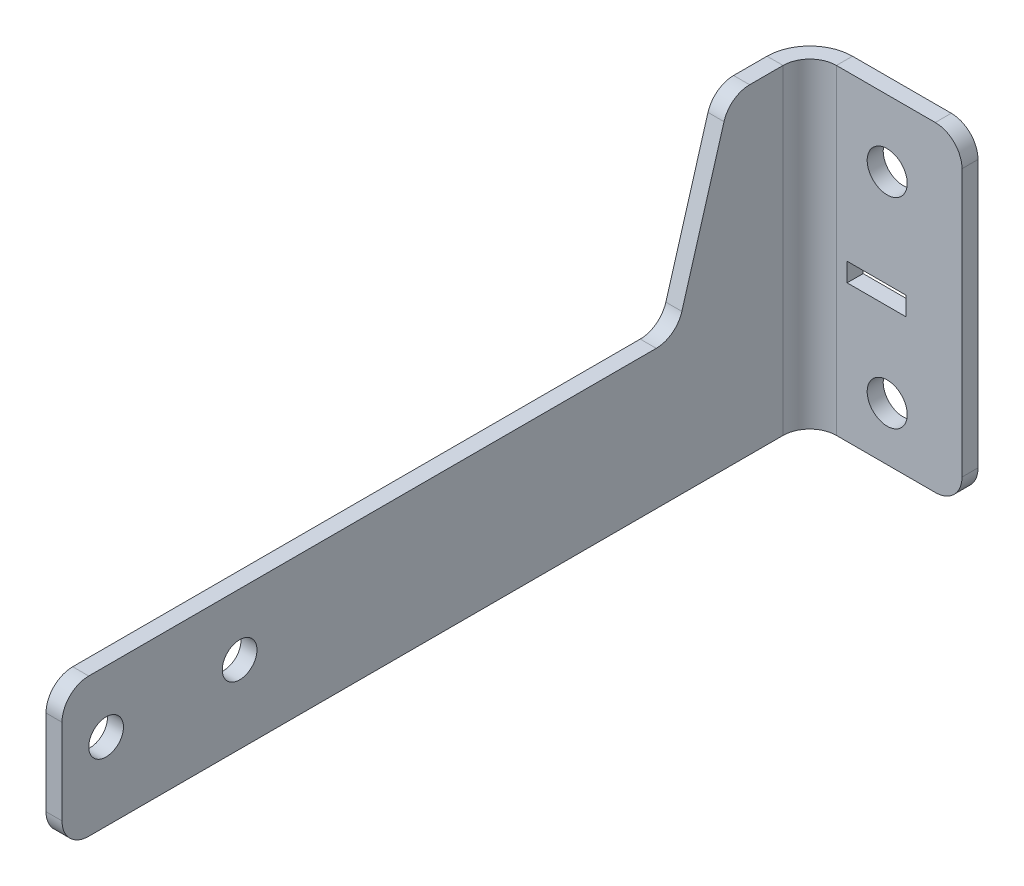
ISO-10303-21;
HEADER;
FILE_DESCRIPTION(('STEP AP214'),'2;1');
FILE_NAME('part.step','',(''),(''),'','','');
FILE_SCHEMA(('AUTOMOTIVE_DESIGN { 1 0 10303 214 1 1 1 1 }'));
ENDSEC;
DATA;
#1=APPLICATION_CONTEXT('core data for automotive mechanical design processes');
#2=APPLICATION_PROTOCOL_DEFINITION('international standard','automotive_design',2000,#1);
#3=PRODUCT_CONTEXT('',#1,'mechanical');
#4=PRODUCT('Part','Part','',(#3));
#5=PRODUCT_RELATED_PRODUCT_CATEGORY('part','',(#4));
#6=PRODUCT_DEFINITION_FORMATION('','',#4);
#7=PRODUCT_DEFINITION_CONTEXT('part definition',#1,'design');
#8=PRODUCT_DEFINITION('design','',#6,#7);
#9=PRODUCT_DEFINITION_SHAPE('','',#8);
#10=(LENGTH_UNIT() NAMED_UNIT(*) SI_UNIT(.MILLI.,.METRE.));
#11=(NAMED_UNIT(*) PLANE_ANGLE_UNIT() SI_UNIT($,.RADIAN.));
#12=(NAMED_UNIT(*) SI_UNIT($,.STERADIAN.) SOLID_ANGLE_UNIT());
#13=UNCERTAINTY_MEASURE_WITH_UNIT(LENGTH_MEASURE(1.E-05),#10,'distance_accuracy_value','');
#14=(GEOMETRIC_REPRESENTATION_CONTEXT(3) GLOBAL_UNCERTAINTY_ASSIGNED_CONTEXT((#13)) GLOBAL_UNIT_ASSIGNED_CONTEXT((#10,
#11,#12)) REPRESENTATION_CONTEXT('',''));
#15=CARTESIAN_POINT('',(0.,0.,0.));
#16=DIRECTION('',(0.,0.,1.));
#17=DIRECTION('',(1.,0.,0.));
#18=AXIS2_PLACEMENT_3D('',#15,#16,#17);
#19=CARTESIAN_POINT('',(28.,-100.,-6.));
#20=DIRECTION('',(0.,-1.,0.));
#21=DIRECTION('',(1.,0.,0.));
#22=AXIS2_PLACEMENT_3D('',#19,#20,#21);
#23=PLANE('',#22);
#24=DIRECTION('',(1.,0.,0.));
#25=VECTOR('',#24,1.);
#26=CARTESIAN_POINT('',(28.,-100.,-6.));
#27=LINE('',#26,#25);
#28=CARTESIAN_POINT('',(-19.,-100.,-6.));
#29=VERTEX_POINT('',#28);
#30=CARTESIAN_POINT('',(18.,-100.,-6.));
#31=VERTEX_POINT('',#30);
#32=EDGE_CURVE('E331',#29,#31,#27,.T.);
#33=ORIENTED_EDGE('',*,*,#32,.T.);
#34=DIRECTION('',(0.,0.,1.));
#35=VECTOR('',#34,1.);
#36=CARTESIAN_POINT('',(18.,-100.,-6.));
#37=LINE('',#36,#35);
#38=CARTESIAN_POINT('',(18.,-100.,0.));
#39=VERTEX_POINT('',#38);
#40=EDGE_CURVE('E334',#31,#39,#37,.T.);
#41=ORIENTED_EDGE('',*,*,#40,.T.);
#42=DIRECTION('',(1.,0.,0.));
#43=VECTOR('',#42,1.);
#44=CARTESIAN_POINT('',(28.,-100.,0.));
#45=LINE('',#44,#43);
#46=CARTESIAN_POINT('',(-19.,-100.,0.));
#47=VERTEX_POINT('',#46);
#48=EDGE_CURVE('E329',#47,#39,#45,.T.);
#49=ORIENTED_EDGE('',*,*,#48,.F.);
#50=DIRECTION('',(0.,0.,-1.));
#51=VECTOR('',#50,1.);
#52=CARTESIAN_POINT('',(-19.,-100.,0.));
#53=LINE('',#52,#51);
#54=EDGE_CURVE('E296',#47,#29,#53,.T.);
#55=ORIENTED_EDGE('',*,*,#54,.T.);
#56=EDGE_LOOP('',(#33,#41,#49,#55));
#57=FACE_BOUND('',#56,.T.);
#58=ADVANCED_FACE('F66',(#57),#23,.T.);
#59=CARTESIAN_POINT('',(0.,0.,-6.));
#60=DIRECTION('',(0.,0.,-1.));
#61=DIRECTION('',(-1.,0.,0.));
#62=AXIS2_PLACEMENT_3D('',#59,#60,#61);
#63=PLANE('',#62);
#64=DIRECTION('',(0.,1.,0.));
#65=VECTOR('',#64,1.);
#66=CARTESIAN_POINT('',(-15.,0.,-6.));
#67=LINE('',#66,#65);
#68=CARTESIAN_POINT('',(-15.,-48.5,-6.));
#69=VERTEX_POINT('',#68);
#70=CARTESIAN_POINT('',(-15.,-41.5,-6.));
#71=VERTEX_POINT('',#70);
#72=EDGE_CURVE('E235',#69,#71,#67,.T.);
#73=ORIENTED_EDGE('',*,*,#72,.F.);
#74=DIRECTION('',(-1.,0.,0.));
#75=VECTOR('',#74,1.);
#76=CARTESIAN_POINT('',(0.,-48.5,-6.));
#77=LINE('',#76,#75);
#78=CARTESIAN_POINT('',(7.00000000000001,-48.5,-6.));
#79=VERTEX_POINT('',#78);
#80=EDGE_CURVE('E228',#79,#69,#77,.T.);
#81=ORIENTED_EDGE('',*,*,#80,.F.);
#82=DIRECTION('',(0.,-1.,0.));
#83=VECTOR('',#82,1.);
#84=CARTESIAN_POINT('',(7.00000000000002,0.,-6.));
#85=LINE('',#84,#83);
#86=CARTESIAN_POINT('',(7.00000000000001,-41.5,-6.));
#87=VERTEX_POINT('',#86);
#88=EDGE_CURVE('E208',#87,#79,#85,.T.);
#89=ORIENTED_EDGE('',*,*,#88,.F.);
#90=DIRECTION('',(1.,0.,0.));
#91=VECTOR('',#90,1.);
#92=CARTESIAN_POINT('',(0.,-41.5,-6.));
#93=LINE('',#92,#91);
#94=EDGE_CURVE('E233',#71,#87,#93,.T.);
#95=ORIENTED_EDGE('',*,*,#94,.F.);
#96=EDGE_LOOP('',(#73,#81,#89,#95));
#97=FACE_BOUND('',#96,.T.);
#98=CARTESIAN_POINT('',(0.,-5.00000000000002,-6.));
#99=DIRECTION('',(0.,0.,-1.));
#100=DIRECTION('',(-1.,0.,0.));
#101=AXIS2_PLACEMENT_3D('',#98,#99,#100);
#102=CIRCLE('',#101,7.5);
#103=CARTESIAN_POINT('',(-7.49999999999999,-5.00000000000002,-6.));
#104=VERTEX_POINT('',#103);
#105=EDGE_CURVE('E321',#104,#104,#102,.T.);
#106=ORIENTED_EDGE('',*,*,#105,.F.);
#107=EDGE_LOOP('',(#106));
#108=FACE_BOUND('',#107,.T.);
#109=CARTESIAN_POINT('',(0.,-80.,-6.));
#110=DIRECTION('',(0.,0.,-1.));
#111=DIRECTION('',(-1.,0.,0.));
#112=AXIS2_PLACEMENT_3D('',#109,#110,#111);
#113=CIRCLE('',#112,7.5);
#114=CARTESIAN_POINT('',(-7.49999999999999,-80.,-6.));
#115=VERTEX_POINT('',#114);
#116=EDGE_CURVE('E316',#115,#115,#113,.T.);
#117=ORIENTED_EDGE('',*,*,#116,.F.);
#118=EDGE_LOOP('',(#117));
#119=FACE_BOUND('',#118,.T.);
#120=DIRECTION('',(0.,1.,0.));
#121=VECTOR('',#120,1.);
#122=CARTESIAN_POINT('',(28.,20.,-6.));
#123=LINE('',#122,#121);
#124=CARTESIAN_POINT('',(28.,-90.,-6.));
#125=VERTEX_POINT('',#124);
#126=CARTESIAN_POINT('',(28.,10.,-6.));
#127=VERTEX_POINT('',#126);
#128=EDGE_CURVE('E325',#125,#127,#123,.T.);
#129=ORIENTED_EDGE('',*,*,#128,.F.);
#130=CARTESIAN_POINT('',(18.,-90.,-6.));
#131=DIRECTION('',(0.,0.,-1.));
#132=DIRECTION('',(-1.,0.,0.));
#133=AXIS2_PLACEMENT_3D('',#130,#131,#132);
#134=CIRCLE('',#133,10.);
#135=EDGE_CURVE('E354',#125,#31,#134,.T.);
#136=ORIENTED_EDGE('',*,*,#135,.T.);
#137=ORIENTED_EDGE('',*,*,#32,.F.);
#138=DIRECTION('',(0.,-1.,0.));
#139=VECTOR('',#138,1.);
#140=CARTESIAN_POINT('',(-19.,-100.,-6.));
#141=LINE('',#140,#139);
#142=CARTESIAN_POINT('',(-19.,20.,-6.));
#143=VERTEX_POINT('',#142);
#144=EDGE_CURVE('E289',#29,#143,#141,.F.);
#145=ORIENTED_EDGE('',*,*,#144,.T.);
#146=DIRECTION('',(-1.,0.,0.));
#147=VECTOR('',#146,1.);
#148=CARTESIAN_POINT('',(28.,20.,-6.));
#149=LINE('',#148,#147);
#150=CARTESIAN_POINT('',(18.,20.,-6.));
#151=VERTEX_POINT('',#150);
#152=EDGE_CURVE('E328',#151,#143,#149,.T.);
#153=ORIENTED_EDGE('',*,*,#152,.F.);
#154=CARTESIAN_POINT('',(18.,10.,-6.));
#155=DIRECTION('',(0.,0.,-1.));
#156=DIRECTION('',(-1.,0.,0.));
#157=AXIS2_PLACEMENT_3D('',#154,#155,#156);
#158=CIRCLE('',#157,10.);
#159=EDGE_CURVE('E352',#151,#127,#158,.T.);
#160=ORIENTED_EDGE('',*,*,#159,.T.);
#161=EDGE_LOOP('',(#129,#136,#137,#145,#153,#160));
#162=FACE_BOUND('',#161,.T.);
#163=ADVANCED_FACE('F443',(#97,#108,#119,#162),#63,.T.);
#164=CARTESIAN_POINT('',(0.,0.,0.));
#165=DIRECTION('',(0.,0.,-1.));
#166=DIRECTION('',(-1.,0.,0.));
#167=AXIS2_PLACEMENT_3D('',#164,#165,#166);
#168=PLANE('',#167);
#169=DIRECTION('',(1.,0.,0.));
#170=VECTOR('',#169,1.);
#171=CARTESIAN_POINT('',(-15.,-48.5,0.));
#172=LINE('',#171,#170);
#173=CARTESIAN_POINT('',(-15.,-48.5,0.));
#174=VERTEX_POINT('',#173);
#175=CARTESIAN_POINT('',(7.00000000000001,-48.5,0.));
#176=VERTEX_POINT('',#175);
#177=EDGE_CURVE('E214',#174,#176,#172,.T.);
#178=ORIENTED_EDGE('',*,*,#177,.F.);
#179=DIRECTION('',(0.,-1.,0.));
#180=VECTOR('',#179,1.);
#181=CARTESIAN_POINT('',(-15.,-41.5,0.));
#182=LINE('',#181,#180);
#183=CARTESIAN_POINT('',(-15.,-41.5,0.));
#184=VERTEX_POINT('',#183);
#185=EDGE_CURVE('E89',#184,#174,#182,.T.);
#186=ORIENTED_EDGE('',*,*,#185,.F.);
#187=DIRECTION('',(-1.,0.,0.));
#188=VECTOR('',#187,1.);
#189=CARTESIAN_POINT('',(-15.,-41.5,0.));
#190=LINE('',#189,#188);
#191=CARTESIAN_POINT('',(7.00000000000001,-41.5,0.));
#192=VERTEX_POINT('',#191);
#193=EDGE_CURVE('E221',#192,#184,#190,.T.);
#194=ORIENTED_EDGE('',*,*,#193,.F.);
#195=DIRECTION('',(0.,1.,0.));
#196=VECTOR('',#195,1.);
#197=CARTESIAN_POINT('',(7.00000000000001,-41.5,0.));
#198=LINE('',#197,#196);
#199=EDGE_CURVE('E205',#176,#192,#198,.T.);
#200=ORIENTED_EDGE('',*,*,#199,.F.);
#201=EDGE_LOOP('',(#178,#186,#194,#200));
#202=FACE_BOUND('',#201,.T.);
#203=CARTESIAN_POINT('',(0.,-80.,0.));
#204=DIRECTION('',(0.,0.,1.));
#205=DIRECTION('',(1.,0.,0.));
#206=AXIS2_PLACEMENT_3D('',#203,#204,#205);
#207=CIRCLE('',#206,7.5);
#208=CARTESIAN_POINT('',(7.50000000000001,-80.,0.));
#209=VERTEX_POINT('',#208);
#210=EDGE_CURVE('E310',#209,#209,#207,.T.);
#211=ORIENTED_EDGE('',*,*,#210,.F.);
#212=EDGE_LOOP('',(#211));
#213=FACE_BOUND('',#212,.T.);
#214=CARTESIAN_POINT('',(0.,-5.00000000000002,0.));
#215=DIRECTION('',(0.,0.,1.));
#216=DIRECTION('',(1.,0.,0.));
#217=AXIS2_PLACEMENT_3D('',#214,#215,#216);
#218=CIRCLE('',#217,7.5);
#219=CARTESIAN_POINT('',(7.50000000000001,-5.00000000000002,0.));
#220=VERTEX_POINT('',#219);
#221=EDGE_CURVE('E313',#220,#220,#218,.T.);
#222=ORIENTED_EDGE('',*,*,#221,.F.);
#223=EDGE_LOOP('',(#222));
#224=FACE_BOUND('',#223,.T.);
#225=ORIENTED_EDGE('',*,*,#48,.T.);
#226=CARTESIAN_POINT('',(18.,-90.,0.));
#227=DIRECTION('',(0.,0.,-1.));
#228=DIRECTION('',(-1.,0.,0.));
#229=AXIS2_PLACEMENT_3D('',#226,#227,#228);
#230=CIRCLE('',#229,10.);
#231=CARTESIAN_POINT('',(28.,-90.,0.));
#232=VERTEX_POINT('',#231);
#233=EDGE_CURVE('E345',#39,#232,#230,.F.);
#234=ORIENTED_EDGE('',*,*,#233,.T.);
#235=DIRECTION('',(0.,1.,0.));
#236=VECTOR('',#235,1.);
#237=CARTESIAN_POINT('',(28.,20.,0.));
#238=LINE('',#237,#236);
#239=CARTESIAN_POINT('',(28.,10.,0.));
#240=VERTEX_POINT('',#239);
#241=EDGE_CURVE('E324',#232,#240,#238,.T.);
#242=ORIENTED_EDGE('',*,*,#241,.T.);
#243=CARTESIAN_POINT('',(18.,10.,0.));
#244=DIRECTION('',(0.,0.,-1.));
#245=DIRECTION('',(-1.,0.,0.));
#246=AXIS2_PLACEMENT_3D('',#243,#244,#245);
#247=CIRCLE('',#246,10.);
#248=CARTESIAN_POINT('',(18.,20.,0.));
#249=VERTEX_POINT('',#248);
#250=EDGE_CURVE('E343',#240,#249,#247,.F.);
#251=ORIENTED_EDGE('',*,*,#250,.T.);
#252=DIRECTION('',(-1.,0.,0.));
#253=VECTOR('',#252,1.);
#254=CARTESIAN_POINT('',(28.,20.,0.));
#255=LINE('',#254,#253);
#256=CARTESIAN_POINT('',(-19.,20.,0.));
#257=VERTEX_POINT('',#256);
#258=EDGE_CURVE('E337',#249,#257,#255,.T.);
#259=ORIENTED_EDGE('',*,*,#258,.T.);
#260=DIRECTION('',(0.,-1.,0.));
#261=VECTOR('',#260,1.);
#262=CARTESIAN_POINT('',(-19.,-100.,0.));
#263=LINE('',#262,#261);
#264=EDGE_CURVE('E302',#47,#257,#263,.F.);
#265=ORIENTED_EDGE('',*,*,#264,.F.);
#266=EDGE_LOOP('',(#225,#234,#242,#251,#259,#265));
#267=FACE_BOUND('',#266,.T.);
#268=ADVANCED_FACE('F218',(#202,#213,#224,#267),#168,.F.);
#269=CARTESIAN_POINT('',(28.,20.,-6.));
#270=DIRECTION('',(1.,0.,0.));
#271=DIRECTION('',(0.,1.,0.));
#272=AXIS2_PLACEMENT_3D('',#269,#270,#271);
#273=PLANE('',#272);
#274=ORIENTED_EDGE('',*,*,#241,.F.);
#275=DIRECTION('',(0.,0.,1.));
#276=VECTOR('',#275,1.);
#277=CARTESIAN_POINT('',(28.,-90.,-6.));
#278=LINE('',#277,#276);
#279=EDGE_CURVE('E350',#232,#125,#278,.F.);
#280=ORIENTED_EDGE('',*,*,#279,.T.);
#281=ORIENTED_EDGE('',*,*,#128,.T.);
#282=DIRECTION('',(0.,0.,1.));
#283=VECTOR('',#282,1.);
#284=CARTESIAN_POINT('',(28.,10.,-6.));
#285=LINE('',#284,#283);
#286=EDGE_CURVE('E347',#127,#240,#285,.T.);
#287=ORIENTED_EDGE('',*,*,#286,.T.);
#288=EDGE_LOOP('',(#274,#280,#281,#287));
#289=FACE_BOUND('',#288,.T.);
#290=ADVANCED_FACE('F455',(#289),#273,.T.);
#291=CARTESIAN_POINT('',(28.,20.,-6.));
#292=DIRECTION('',(0.,1.,0.));
#293=DIRECTION('',(-1.,0.,0.));
#294=AXIS2_PLACEMENT_3D('',#291,#292,#293);
#295=PLANE('',#294);
#296=ORIENTED_EDGE('',*,*,#258,.F.);
#297=DIRECTION('',(0.,0.,1.));
#298=VECTOR('',#297,1.);
#299=CARTESIAN_POINT('',(18.,20.,-6.));
#300=LINE('',#299,#298);
#301=EDGE_CURVE('E385',#249,#151,#300,.F.);
#302=ORIENTED_EDGE('',*,*,#301,.T.);
#303=ORIENTED_EDGE('',*,*,#152,.T.);
#304=DIRECTION('',(0.,0.,-1.));
#305=VECTOR('',#304,1.);
#306=CARTESIAN_POINT('',(-19.,20.,0.));
#307=LINE('',#306,#305);
#308=EDGE_CURVE('E307',#257,#143,#307,.T.);
#309=ORIENTED_EDGE('',*,*,#308,.F.);
#310=EDGE_LOOP('',(#296,#302,#303,#309));
#311=FACE_BOUND('',#310,.T.);
#312=ADVANCED_FACE('F462',(#311),#295,.T.);
#313=CARTESIAN_POINT('',(0.,-80.,-10.));
#314=DIRECTION('',(0.,0.,1.));
#315=DIRECTION('',(1.,0.,0.));
#316=AXIS2_PLACEMENT_3D('',#313,#314,#315);
#317=CYLINDRICAL_SURFACE('',#316,7.5);
#318=ORIENTED_EDGE('',*,*,#116,.T.);
#319=EDGE_LOOP('',(#318));
#320=FACE_BOUND('',#319,.T.);
#321=ORIENTED_EDGE('',*,*,#210,.T.);
#322=EDGE_LOOP('',(#321));
#323=FACE_BOUND('',#322,.T.);
#324=ADVANCED_FACE('F464',(#320,#323),#317,.F.);
#325=CARTESIAN_POINT('',(0.,-5.00000000000002,-10.));
#326=DIRECTION('',(0.,0.,1.));
#327=DIRECTION('',(1.,0.,0.));
#328=AXIS2_PLACEMENT_3D('',#325,#326,#327);
#329=CYLINDRICAL_SURFACE('',#328,7.5);
#330=ORIENTED_EDGE('',*,*,#105,.T.);
#331=EDGE_LOOP('',(#330));
#332=FACE_BOUND('',#331,.T.);
#333=ORIENTED_EDGE('',*,*,#221,.T.);
#334=EDGE_LOOP('',(#333));
#335=FACE_BOUND('',#334,.T.);
#336=ADVANCED_FACE('F470',(#332,#335),#329,.F.);
#337=CARTESIAN_POINT('',(-19.,20.,10.));
#338=DIRECTION('',(0.,1.,0.));
#339=DIRECTION('',(0.,0.,1.));
#340=AXIS2_PLACEMENT_3D('',#337,#338,#339);
#341=PLANE('',#340);
#342=DIRECTION('',(1.,0.,0.));
#343=VECTOR('',#342,1.);
#344=CARTESIAN_POINT('',(-35.,20.,9.99999999999995));
#345=LINE('',#344,#343);
#346=CARTESIAN_POINT('',(-29.,20.,9.99999999999997));
#347=VERTEX_POINT('',#346);
#348=CARTESIAN_POINT('',(-35.,20.,9.99999999999995));
#349=VERTEX_POINT('',#348);
#350=EDGE_CURVE('E249',#347,#349,#345,.F.);
#351=ORIENTED_EDGE('',*,*,#350,.F.);
#352=CARTESIAN_POINT('',(-19.,20.,10.));
#353=DIRECTION('',(0.,-1.,0.));
#354=DIRECTION('',(0.,0.,-1.));
#355=AXIS2_PLACEMENT_3D('',#352,#353,#354);
#356=CIRCLE('',#355,10.);
#357=EDGE_CURVE('E299',#257,#347,#356,.F.);
#358=ORIENTED_EDGE('',*,*,#357,.F.);
#359=ORIENTED_EDGE('',*,*,#308,.T.);
#360=CARTESIAN_POINT('',(-19.,20.,10.));
#361=DIRECTION('',(0.,-1.,0.));
#362=DIRECTION('',(0.,0.,-1.));
#363=AXIS2_PLACEMENT_3D('',#360,#361,#362);
#364=CIRCLE('',#363,16.);
#365=EDGE_CURVE('E292',#143,#349,#364,.F.);
#366=ORIENTED_EDGE('',*,*,#365,.T.);
#367=EDGE_LOOP('',(#351,#358,#359,#366));
#368=FACE_BOUND('',#367,.T.);
#369=ADVANCED_FACE('F420',(#368),#341,.T.);
#370=CARTESIAN_POINT('',(-19.,-100.,10.));
#371=DIRECTION('',(0.,1.,0.));
#372=DIRECTION('',(0.,0.,1.));
#373=AXIS2_PLACEMENT_3D('',#370,#371,#372);
#374=PLANE('',#373);
#375=CARTESIAN_POINT('',(-19.,-100.,10.));
#376=DIRECTION('',(0.,-1.,0.));
#377=DIRECTION('',(0.,0.,-1.));
#378=AXIS2_PLACEMENT_3D('',#375,#376,#377);
#379=CIRCLE('',#378,10.);
#380=CARTESIAN_POINT('',(-29.,-100.,9.99999999999997));
#381=VERTEX_POINT('',#380);
#382=EDGE_CURVE('E252',#381,#47,#379,.T.);
#383=ORIENTED_EDGE('',*,*,#382,.F.);
#384=DIRECTION('',(1.,0.,0.));
#385=VECTOR('',#384,1.);
#386=CARTESIAN_POINT('',(-29.,-100.,9.99999999999998));
#387=LINE('',#386,#385);
#388=CARTESIAN_POINT('',(-35.,-100.,9.99999999999996));
#389=VERTEX_POINT('',#388);
#390=EDGE_CURVE('E282',#381,#389,#387,.F.);
#391=ORIENTED_EDGE('',*,*,#390,.T.);
#392=CARTESIAN_POINT('',(-19.,-100.,10.));
#393=DIRECTION('',(0.,-1.,0.));
#394=DIRECTION('',(0.,0.,-1.));
#395=AXIS2_PLACEMENT_3D('',#392,#393,#394);
#396=CIRCLE('',#395,16.);
#397=EDGE_CURVE('E293',#389,#29,#396,.T.);
#398=ORIENTED_EDGE('',*,*,#397,.T.);
#399=ORIENTED_EDGE('',*,*,#54,.F.);
#400=EDGE_LOOP('',(#383,#391,#398,#399));
#401=FACE_BOUND('',#400,.T.);
#402=ADVANCED_FACE('F435',(#401),#374,.F.);
#403=CARTESIAN_POINT('',(-19.,-100.,10.));
#404=DIRECTION('',(0.,-1.,0.));
#405=DIRECTION('',(-1.,0.,0.));
#406=AXIS2_PLACEMENT_3D('',#403,#404,#405);
#407=CYLINDRICAL_SURFACE('',#406,16.);
#408=ORIENTED_EDGE('',*,*,#144,.F.);
#409=ORIENTED_EDGE('',*,*,#397,.F.);
#410=DIRECTION('',(0.,-1.,0.));
#411=VECTOR('',#410,1.);
#412=CARTESIAN_POINT('',(-35.,0.,9.99999999999995));
#413=LINE('',#412,#411);
#414=EDGE_CURVE('E279',#349,#389,#413,.T.);
#415=ORIENTED_EDGE('',*,*,#414,.F.);
#416=ORIENTED_EDGE('',*,*,#365,.F.);
#417=EDGE_LOOP('',(#408,#409,#415,#416));
#418=FACE_BOUND('',#417,.T.);
#419=ADVANCED_FACE('F438',(#418),#407,.T.);
#420=CARTESIAN_POINT('',(-19.,-100.,10.));
#421=DIRECTION('',(0.,-1.,0.));
#422=DIRECTION('',(-1.,0.,0.));
#423=AXIS2_PLACEMENT_3D('',#420,#421,#422);
#424=CYLINDRICAL_SURFACE('',#423,10.);
#425=ORIENTED_EDGE('',*,*,#264,.T.);
#426=ORIENTED_EDGE('',*,*,#357,.T.);
#427=DIRECTION('',(0.,1.,0.));
#428=VECTOR('',#427,1.);
#429=CARTESIAN_POINT('',(-29.,20.,9.99999999999997));
#430=LINE('',#429,#428);
#431=EDGE_CURVE('E285',#347,#381,#430,.F.);
#432=ORIENTED_EDGE('',*,*,#431,.T.);
#433=ORIENTED_EDGE('',*,*,#382,.T.);
#434=EDGE_LOOP('',(#425,#426,#432,#433));
#435=FACE_BOUND('',#434,.T.);
#436=ADVANCED_FACE('F425',(#435),#424,.F.);
#437=CARTESIAN_POINT('',(-35.000000000001,-100.,280.));
#438=DIRECTION('',(0.,1.,0.));
#439=DIRECTION('',(-1.,0.,0.));
#440=AXIS2_PLACEMENT_3D('',#437,#438,#439);
#441=PLANE('',#440);
#442=DIRECTION('',(0.,0.,1.));
#443=VECTOR('',#442,1.);
#444=CARTESIAN_POINT('',(-29.000000000001,-100.,280.));
#445=LINE('',#444,#443);
#446=CARTESIAN_POINT('',(-29.0000000000009,-100.,270.));
#447=VERTEX_POINT('',#446);
#448=EDGE_CURVE('E276',#381,#447,#445,.T.);
#449=ORIENTED_EDGE('',*,*,#448,.T.);
#450=DIRECTION('',(1.,0.,0.));
#451=VECTOR('',#450,1.);
#452=CARTESIAN_POINT('',(-35.0000000000009,-100.,270.));
#453=LINE('',#452,#451);
#454=CARTESIAN_POINT('',(-35.0000000000009,-100.,270.));
#455=VERTEX_POINT('',#454);
#456=EDGE_CURVE('E367',#447,#455,#453,.F.);
#457=ORIENTED_EDGE('',*,*,#456,.T.);
#458=DIRECTION('',(0.,0.,-1.));
#459=VECTOR('',#458,1.);
#460=CARTESIAN_POINT('',(-35.,-100.,-1.33334187512413E-13));
#461=LINE('',#460,#459);
#462=EDGE_CURVE('E262',#389,#455,#461,.F.);
#463=ORIENTED_EDGE('',*,*,#462,.F.);
#464=ORIENTED_EDGE('',*,*,#390,.F.);
#465=EDGE_LOOP('',(#449,#457,#463,#464));
#466=FACE_BOUND('',#465,.T.);
#467=ADVANCED_FACE('F433',(#466),#441,.F.);
#468=CARTESIAN_POINT('',(-35.,20.,0.));
#469=DIRECTION('',(0.,-1.,0.));
#470=DIRECTION('',(1.,0.,0.));
#471=AXIS2_PLACEMENT_3D('',#468,#469,#470);
#472=PLANE('',#471);
#473=DIRECTION('',(0.,0.,1.));
#474=VECTOR('',#473,1.);
#475=CARTESIAN_POINT('',(-35.,20.,-1.43246893089424E-13));
#476=LINE('',#475,#474);
#477=CARTESIAN_POINT('',(-35.0000000000001,20.,22.5176205019592));
#478=VERTEX_POINT('',#477);
#479=EDGE_CURVE('E250',#478,#349,#476,.F.);
#480=ORIENTED_EDGE('',*,*,#479,.F.);
#481=DIRECTION('',(1.,0.,0.));
#482=VECTOR('',#481,1.);
#483=CARTESIAN_POINT('',(-35.0000000000001,20.,22.5176205019592));
#484=LINE('',#483,#482);
#485=CARTESIAN_POINT('',(-29.0000000000001,20.,22.5176205019592));
#486=VERTEX_POINT('',#485);
#487=EDGE_CURVE('E387',#478,#486,#484,.T.);
#488=ORIENTED_EDGE('',*,*,#487,.T.);
#489=DIRECTION('',(0.,0.,-1.));
#490=VECTOR('',#489,1.);
#491=CARTESIAN_POINT('',(-29.,20.,0.));
#492=LINE('',#491,#490);
#493=EDGE_CURVE('E265',#486,#347,#492,.T.);
#494=ORIENTED_EDGE('',*,*,#493,.T.);
#495=ORIENTED_EDGE('',*,*,#350,.T.);
#496=EDGE_LOOP('',(#480,#488,#494,#495));
#497=FACE_BOUND('',#496,.T.);
#498=ADVANCED_FACE('F415',(#497),#472,.F.);
#499=CARTESIAN_POINT('',(-35.,0.,-1.43246893089424E-13));
#500=DIRECTION('',(-1.,0.,0.));
#501=DIRECTION('',(0.,0.,1.));
#502=AXIS2_PLACEMENT_3D('',#499,#500,#501);
#503=PLANE('',#502);
#504=CARTESIAN_POINT('',(-35.0000000000009,-71.,263.5));
#505=DIRECTION('',(-1.,0.,0.));
#506=DIRECTION('',(0.,0.,1.));
#507=AXIS2_PLACEMENT_3D('',#504,#505,#506);
#508=CIRCLE('',#507,6.50000000000002);
#509=CARTESIAN_POINT('',(-35.0000000000009,-71.,270.));
#510=VERTEX_POINT('',#509);
#511=EDGE_CURVE('E246',#510,#510,#508,.T.);
#512=ORIENTED_EDGE('',*,*,#511,.F.);
#513=EDGE_LOOP('',(#512));
#514=FACE_BOUND('',#513,.T.);
#515=CARTESIAN_POINT('',(-35.0000000000007,-71.,213.5));
#516=DIRECTION('',(-1.,0.,0.));
#517=DIRECTION('',(0.,0.,1.));
#518=AXIS2_PLACEMENT_3D('',#515,#516,#517);
#519=CIRCLE('',#518,6.50000000000002);
#520=CARTESIAN_POINT('',(-35.0000000000008,-71.,220.));
#521=VERTEX_POINT('',#520);
#522=EDGE_CURVE('E241',#521,#521,#519,.T.);
#523=ORIENTED_EDGE('',*,*,#522,.F.);
#524=EDGE_LOOP('',(#523));
#525=FACE_BOUND('',#524,.T.);
#526=ORIENTED_EDGE('',*,*,#462,.T.);
#527=CARTESIAN_POINT('',(-35.0000000000009,-90.,270.));
#528=DIRECTION('',(-1.,0.,0.));
#529=DIRECTION('',(0.,0.,1.));
#530=AXIS2_PLACEMENT_3D('',#527,#528,#529);
#531=CIRCLE('',#530,10.);
#532=CARTESIAN_POINT('',(-35.000000000001,-90.,280.));
#533=VERTEX_POINT('',#532);
#534=EDGE_CURVE('E373',#455,#533,#531,.T.);
#535=ORIENTED_EDGE('',*,*,#534,.T.);
#536=DIRECTION('',(0.,-1.,0.));
#537=VECTOR('',#536,1.);
#538=CARTESIAN_POINT('',(-35.000000000001,0.,280.));
#539=LINE('',#538,#537);
#540=CARTESIAN_POINT('',(-35.000000000001,-58.,280.));
#541=VERTEX_POINT('',#540);
#542=EDGE_CURVE('E259',#533,#541,#539,.F.);
#543=ORIENTED_EDGE('',*,*,#542,.T.);
#544=CARTESIAN_POINT('',(-35.0000000000009,-58.,270.));
#545=DIRECTION('',(-1.,0.,0.));
#546=DIRECTION('',(0.,0.,1.));
#547=AXIS2_PLACEMENT_3D('',#544,#545,#546);
#548=CIRCLE('',#547,10.);
#549=CARTESIAN_POINT('',(-35.0000000000009,-48.,270.));
#550=VERTEX_POINT('',#549);
#551=EDGE_CURVE('E371',#541,#550,#548,.T.);
#552=ORIENTED_EDGE('',*,*,#551,.T.);
#553=DIRECTION('',(0.,0.,1.));
#554=VECTOR('',#553,1.);
#555=CARTESIAN_POINT('',(-35.,-48.,-1.43246893089424E-13));
#556=LINE('',#555,#554);
#557=CARTESIAN_POINT('',(-35.0000000000002,-48.,57.4823794980408));
#558=VERTEX_POINT('',#557);
#559=EDGE_CURVE('E256',#550,#558,#556,.F.);
#560=ORIENTED_EDGE('',*,*,#559,.T.);
#561=CARTESIAN_POINT('',(-35.0000000000002,-38.,57.4823794980408));
#562=DIRECTION('',(-1.,0.,0.));
#563=DIRECTION('',(0.,0.,1.));
#564=AXIS2_PLACEMENT_3D('',#561,#562,#563);
#565=CIRCLE('',#564,10.);
#566=CARTESIAN_POINT('',(-35.0000000000002,-40.8216632399155,47.8887244823281));
#567=VERTEX_POINT('',#566);
#568=EDGE_CURVE('E13',#558,#567,#565,.F.);
#569=ORIENTED_EDGE('',*,*,#568,.T.);
#570=DIRECTION('',(0.,-0.959365501571271,0.28216632399155));
#571=VECTOR('',#570,1.);
#572=CARTESIAN_POINT('',(-35.0000000000001,9.71337579617838,33.0254777070063));
#573=LINE('',#572,#571);
#574=CARTESIAN_POINT('',(-35.0000000000001,12.8216632399155,32.1112755176719));
#575=VERTEX_POINT('',#574);
#576=EDGE_CURVE('E253',#567,#575,#573,.F.);
#577=ORIENTED_EDGE('',*,*,#576,.T.);
#578=CARTESIAN_POINT('',(-35.0000000000001,10.,22.5176205019592));
#579=DIRECTION('',(-1.,0.,0.));
#580=DIRECTION('',(0.,0.,1.));
#581=AXIS2_PLACEMENT_3D('',#578,#579,#580);
#582=CIRCLE('',#581,10.);
#583=EDGE_CURVE('E369',#575,#478,#582,.T.);
#584=ORIENTED_EDGE('',*,*,#583,.T.);
#585=ORIENTED_EDGE('',*,*,#479,.T.);
#586=ORIENTED_EDGE('',*,*,#414,.T.);
#587=EDGE_LOOP('',(#526,#535,#543,#552,#560,#569,#577,#584,#585,#586));
#588=FACE_BOUND('',#587,.T.);
#589=ADVANCED_FACE('F405',(#514,#525,#588),#503,.T.);
#590=CARTESIAN_POINT('',(-29.,0.,-1.22298005056365E-13));
#591=DIRECTION('',(-1.,0.,0.));
#592=DIRECTION('',(0.,0.,1.));
#593=AXIS2_PLACEMENT_3D('',#590,#591,#592);
#594=PLANE('',#593);
#595=CARTESIAN_POINT('',(-29.0000000000009,-71.,263.5));
#596=DIRECTION('',(1.,0.,0.));
#597=DIRECTION('',(0.,0.,-1.));
#598=AXIS2_PLACEMENT_3D('',#595,#596,#597);
#599=CIRCLE('',#598,6.50000000000002);
#600=CARTESIAN_POINT('',(-29.0000000000009,-71.,257.));
#601=VERTEX_POINT('',#600);
#602=EDGE_CURVE('E238',#601,#601,#599,.T.);
#603=ORIENTED_EDGE('',*,*,#602,.F.);
#604=EDGE_LOOP('',(#603));
#605=FACE_BOUND('',#604,.T.);
#606=CARTESIAN_POINT('',(-29.0000000000007,-71.,213.5));
#607=DIRECTION('',(1.,0.,0.));
#608=DIRECTION('',(0.,0.,-1.));
#609=AXIS2_PLACEMENT_3D('',#606,#607,#608);
#610=CIRCLE('',#609,6.50000000000002);
#611=CARTESIAN_POINT('',(-29.0000000000007,-71.,207.));
#612=VERTEX_POINT('',#611);
#613=EDGE_CURVE('E237',#612,#612,#610,.T.);
#614=ORIENTED_EDGE('',*,*,#613,.F.);
#615=EDGE_LOOP('',(#614));
#616=FACE_BOUND('',#615,.T.);
#617=DIRECTION('',(0.,1.,0.));
#618=VECTOR('',#617,1.);
#619=CARTESIAN_POINT('',(-29.000000000001,-48.,280.));
#620=LINE('',#619,#618);
#621=CARTESIAN_POINT('',(-29.000000000001,-90.,280.));
#622=VERTEX_POINT('',#621);
#623=CARTESIAN_POINT('',(-29.000000000001,-58.,280.));
#624=VERTEX_POINT('',#623);
#625=EDGE_CURVE('E273',#622,#624,#620,.T.);
#626=ORIENTED_EDGE('',*,*,#625,.F.);
#627=CARTESIAN_POINT('',(-29.0000000000009,-90.,270.));
#628=DIRECTION('',(-1.,0.,0.));
#629=DIRECTION('',(0.,0.,1.));
#630=AXIS2_PLACEMENT_3D('',#627,#628,#629);
#631=CIRCLE('',#630,10.);
#632=EDGE_CURVE('E365',#622,#447,#631,.F.);
#633=ORIENTED_EDGE('',*,*,#632,.T.);
#634=ORIENTED_EDGE('',*,*,#448,.F.);
#635=ORIENTED_EDGE('',*,*,#431,.F.);
#636=ORIENTED_EDGE('',*,*,#493,.F.);
#637=CARTESIAN_POINT('',(-29.0000000000001,10.,22.5176205019592));
#638=DIRECTION('',(-1.,0.,0.));
#639=DIRECTION('',(0.,0.,1.));
#640=AXIS2_PLACEMENT_3D('',#637,#638,#639);
#641=CIRCLE('',#640,10.);
#642=CARTESIAN_POINT('',(-29.0000000000001,12.8216632399155,32.1112755176719));
#643=VERTEX_POINT('',#642);
#644=EDGE_CURVE('E361',#486,#643,#641,.F.);
#645=ORIENTED_EDGE('',*,*,#644,.T.);
#646=DIRECTION('',(0.,0.959365501571271,-0.28216632399155));
#647=VECTOR('',#646,1.);
#648=CARTESIAN_POINT('',(-29.0000000000001,20.,30.));
#649=LINE('',#648,#647);
#650=CARTESIAN_POINT('',(-29.0000000000002,-40.8216632399155,47.8887244823281));
#651=VERTEX_POINT('',#650);
#652=EDGE_CURVE('E267',#651,#643,#649,.T.);
#653=ORIENTED_EDGE('',*,*,#652,.F.);
#654=CARTESIAN_POINT('',(-29.0000000000002,-38.,57.4823794980408));
#655=DIRECTION('',(-1.,0.,0.));
#656=DIRECTION('',(0.,0.,1.));
#657=AXIS2_PLACEMENT_3D('',#654,#655,#656);
#658=CIRCLE('',#657,10.);
#659=CARTESIAN_POINT('',(-29.0000000000002,-48.,57.4823794980408));
#660=VERTEX_POINT('',#659);
#661=EDGE_CURVE('E74',#651,#660,#658,.T.);
#662=ORIENTED_EDGE('',*,*,#661,.T.);
#663=DIRECTION('',(0.,0.,-1.));
#664=VECTOR('',#663,1.);
#665=CARTESIAN_POINT('',(-29.0000000000002,-48.,50.));
#666=LINE('',#665,#664);
#667=CARTESIAN_POINT('',(-29.0000000000009,-48.,270.));
#668=VERTEX_POINT('',#667);
#669=EDGE_CURVE('E270',#668,#660,#666,.T.);
#670=ORIENTED_EDGE('',*,*,#669,.F.);
#671=CARTESIAN_POINT('',(-29.0000000000009,-58.,270.));
#672=DIRECTION('',(-1.,0.,0.));
#673=DIRECTION('',(0.,0.,1.));
#674=AXIS2_PLACEMENT_3D('',#671,#672,#673);
#675=CIRCLE('',#674,10.);
#676=EDGE_CURVE('E363',#668,#624,#675,.F.);
#677=ORIENTED_EDGE('',*,*,#676,.T.);
#678=EDGE_LOOP('',(#626,#633,#634,#635,#636,#645,#653,#662,#670,#677));
#679=FACE_BOUND('',#678,.T.);
#680=ADVANCED_FACE('F393',(#605,#616,#679),#594,.F.);
#681=CARTESIAN_POINT('',(-35.000000000001,-48.,280.));
#682=DIRECTION('',(0.,0.,-1.));
#683=DIRECTION('',(-1.,0.,0.));
#684=AXIS2_PLACEMENT_3D('',#681,#682,#683);
#685=PLANE('',#684);
#686=ORIENTED_EDGE('',*,*,#542,.F.);
#687=DIRECTION('',(1.,0.,0.));
#688=VECTOR('',#687,1.);
#689=CARTESIAN_POINT('',(-35.000000000001,-90.,280.));
#690=LINE('',#689,#688);
#691=EDGE_CURVE('E358',#533,#622,#690,.T.);
#692=ORIENTED_EDGE('',*,*,#691,.T.);
#693=ORIENTED_EDGE('',*,*,#625,.T.);
#694=DIRECTION('',(1.,0.,0.));
#695=VECTOR('',#694,1.);
#696=CARTESIAN_POINT('',(-35.000000000001,-58.,280.));
#697=LINE('',#696,#695);
#698=EDGE_CURVE('E356',#624,#541,#697,.F.);
#699=ORIENTED_EDGE('',*,*,#698,.T.);
#700=EDGE_LOOP('',(#686,#692,#693,#699));
#701=FACE_BOUND('',#700,.T.);
#702=ADVANCED_FACE('F497',(#701),#685,.F.);
#703=CARTESIAN_POINT('',(-35.0000000000002,-48.,50.));
#704=DIRECTION('',(0.,-1.,0.));
#705=DIRECTION('',(1.,0.,0.));
#706=AXIS2_PLACEMENT_3D('',#703,#704,#705);
#707=PLANE('',#706);
#708=ORIENTED_EDGE('',*,*,#559,.F.);
#709=DIRECTION('',(1.,0.,0.));
#710=VECTOR('',#709,1.);
#711=CARTESIAN_POINT('',(-35.0000000000009,-48.,270.));
#712=LINE('',#711,#710);
#713=EDGE_CURVE('E377',#550,#668,#712,.T.);
#714=ORIENTED_EDGE('',*,*,#713,.T.);
#715=ORIENTED_EDGE('',*,*,#669,.T.);
#716=DIRECTION('',(1.,0.,0.));
#717=VECTOR('',#716,1.);
#718=CARTESIAN_POINT('',(-35.0000000000002,-48.,57.4823794980408));
#719=LINE('',#718,#717);
#720=EDGE_CURVE('E375',#660,#558,#719,.F.);
#721=ORIENTED_EDGE('',*,*,#720,.T.);
#722=EDGE_LOOP('',(#708,#714,#715,#721));
#723=FACE_BOUND('',#722,.T.);
#724=ADVANCED_FACE('F399',(#723),#707,.F.);
#725=CARTESIAN_POINT('',(-35.0000000000001,20.,30.));
#726=DIRECTION('',(0.,-0.28216632399155,-0.95936550157127));
#727=DIRECTION('',(0.,0.959365501571271,-0.28216632399155));
#728=AXIS2_PLACEMENT_3D('',#725,#726,#727);
#729=PLANE('',#728);
#730=ORIENTED_EDGE('',*,*,#576,.F.);
#731=DIRECTION('',(1.,0.,0.));
#732=VECTOR('',#731,1.);
#733=CARTESIAN_POINT('',(-29.0000000000002,-40.8216632399155,47.8887244823281));
#734=LINE('',#733,#732);
#735=EDGE_CURVE('E382',#567,#651,#734,.T.);
#736=ORIENTED_EDGE('',*,*,#735,.T.);
#737=ORIENTED_EDGE('',*,*,#652,.T.);
#738=DIRECTION('',(1.,0.,0.));
#739=VECTOR('',#738,1.);
#740=CARTESIAN_POINT('',(-35.0000000000001,12.8216632399155,32.1112755176719));
#741=LINE('',#740,#739);
#742=EDGE_CURVE('E380',#643,#575,#741,.F.);
#743=ORIENTED_EDGE('',*,*,#742,.T.);
#744=EDGE_LOOP('',(#730,#736,#737,#743));
#745=FACE_BOUND('',#744,.T.);
#746=ADVANCED_FACE('F408',(#745),#729,.F.);
#747=CARTESIAN_POINT('',(-39.0000000000007,-71.,213.5));
#748=DIRECTION('',(1.,0.,0.));
#749=DIRECTION('',(0.,0.,-1.));
#750=AXIS2_PLACEMENT_3D('',#747,#748,#749);
#751=CYLINDRICAL_SURFACE('',#750,6.50000000000002);
#752=ORIENTED_EDGE('',*,*,#522,.T.);
#753=EDGE_LOOP('',(#752));
#754=FACE_BOUND('',#753,.T.);
#755=ORIENTED_EDGE('',*,*,#613,.T.);
#756=EDGE_LOOP('',(#755));
#757=FACE_BOUND('',#756,.T.);
#758=ADVANCED_FACE('F505',(#754,#757),#751,.F.);
#759=CARTESIAN_POINT('',(-39.0000000000009,-71.,263.5));
#760=DIRECTION('',(1.,0.,0.));
#761=DIRECTION('',(0.,0.,-1.));
#762=AXIS2_PLACEMENT_3D('',#759,#760,#761);
#763=CYLINDRICAL_SURFACE('',#762,6.50000000000002);
#764=ORIENTED_EDGE('',*,*,#511,.T.);
#765=EDGE_LOOP('',(#764));
#766=FACE_BOUND('',#765,.T.);
#767=ORIENTED_EDGE('',*,*,#602,.T.);
#768=EDGE_LOOP('',(#767));
#769=FACE_BOUND('',#768,.T.);
#770=ADVANCED_FACE('F516',(#766,#769),#763,.F.);
#771=CARTESIAN_POINT('',(18.,-90.,-6.));
#772=DIRECTION('',(0.,0.,1.));
#773=DIRECTION('',(1.,0.,0.));
#774=AXIS2_PLACEMENT_3D('',#771,#772,#773);
#775=CYLINDRICAL_SURFACE('',#774,10.);
#776=ORIENTED_EDGE('',*,*,#135,.F.);
#777=ORIENTED_EDGE('',*,*,#279,.F.);
#778=ORIENTED_EDGE('',*,*,#233,.F.);
#779=ORIENTED_EDGE('',*,*,#40,.F.);
#780=EDGE_LOOP('',(#776,#777,#778,#779));
#781=FACE_BOUND('',#780,.T.);
#782=ADVANCED_FACE('F450',(#781),#775,.T.);
#783=CARTESIAN_POINT('',(-35.0000000000009,-90.,270.));
#784=DIRECTION('',(1.,0.,0.));
#785=DIRECTION('',(0.,0.,-1.));
#786=AXIS2_PLACEMENT_3D('',#783,#784,#785);
#787=CYLINDRICAL_SURFACE('',#786,10.);
#788=ORIENTED_EDGE('',*,*,#534,.F.);
#789=ORIENTED_EDGE('',*,*,#456,.F.);
#790=ORIENTED_EDGE('',*,*,#632,.F.);
#791=ORIENTED_EDGE('',*,*,#691,.F.);
#792=EDGE_LOOP('',(#788,#789,#790,#791));
#793=FACE_BOUND('',#792,.T.);
#794=ADVANCED_FACE('F604',(#793),#787,.T.);
#795=CARTESIAN_POINT('',(-35.0000000000009,-58.,270.));
#796=DIRECTION('',(1.,0.,0.));
#797=DIRECTION('',(0.,0.,-1.));
#798=AXIS2_PLACEMENT_3D('',#795,#796,#797);
#799=CYLINDRICAL_SURFACE('',#798,10.);
#800=ORIENTED_EDGE('',*,*,#551,.F.);
#801=ORIENTED_EDGE('',*,*,#698,.F.);
#802=ORIENTED_EDGE('',*,*,#676,.F.);
#803=ORIENTED_EDGE('',*,*,#713,.F.);
#804=EDGE_LOOP('',(#800,#801,#802,#803));
#805=FACE_BOUND('',#804,.T.);
#806=ADVANCED_FACE('F596',(#805),#799,.T.);
#807=CARTESIAN_POINT('',(-35.0000000000002,-38.,57.4823794980408));
#808=DIRECTION('',(-1.,0.,0.));
#809=DIRECTION('',(0.,0.,1.));
#810=AXIS2_PLACEMENT_3D('',#807,#808,#809);
#811=CYLINDRICAL_SURFACE('',#810,10.);
#812=ORIENTED_EDGE('',*,*,#568,.F.);
#813=ORIENTED_EDGE('',*,*,#720,.F.);
#814=ORIENTED_EDGE('',*,*,#661,.F.);
#815=ORIENTED_EDGE('',*,*,#735,.F.);
#816=EDGE_LOOP('',(#812,#813,#814,#815));
#817=FACE_BOUND('',#816,.T.);
#818=ADVANCED_FACE('F402',(#817),#811,.F.);
#819=CARTESIAN_POINT('',(18.,10.,-6.));
#820=DIRECTION('',(0.,0.,1.));
#821=DIRECTION('',(1.,0.,0.));
#822=AXIS2_PLACEMENT_3D('',#819,#820,#821);
#823=CYLINDRICAL_SURFACE('',#822,10.);
#824=ORIENTED_EDGE('',*,*,#159,.F.);
#825=ORIENTED_EDGE('',*,*,#301,.F.);
#826=ORIENTED_EDGE('',*,*,#250,.F.);
#827=ORIENTED_EDGE('',*,*,#286,.F.);
#828=EDGE_LOOP('',(#824,#825,#826,#827));
#829=FACE_BOUND('',#828,.T.);
#830=ADVANCED_FACE('F458',(#829),#823,.T.);
#831=CARTESIAN_POINT('',(-35.0000000000001,10.,22.5176205019592));
#832=DIRECTION('',(1.,0.,0.));
#833=DIRECTION('',(0.,0.,-1.));
#834=AXIS2_PLACEMENT_3D('',#831,#832,#833);
#835=CYLINDRICAL_SURFACE('',#834,10.);
#836=ORIENTED_EDGE('',*,*,#583,.F.);
#837=ORIENTED_EDGE('',*,*,#742,.F.);
#838=ORIENTED_EDGE('',*,*,#644,.F.);
#839=ORIENTED_EDGE('',*,*,#487,.F.);
#840=EDGE_LOOP('',(#836,#837,#838,#839));
#841=FACE_BOUND('',#840,.T.);
#842=ADVANCED_FACE('F68',(#841),#835,.T.);
#843=CARTESIAN_POINT('',(-15.,-41.5,-10.));
#844=DIRECTION('',(-1.,0.,0.));
#845=DIRECTION('',(0.,0.,1.));
#846=AXIS2_PLACEMENT_3D('',#843,#844,#845);
#847=PLANE('',#846);
#848=ORIENTED_EDGE('',*,*,#72,.T.);
#849=DIRECTION('',(0.,0.,1.));
#850=VECTOR('',#849,1.);
#851=CARTESIAN_POINT('',(-15.,-41.5,-10.));
#852=LINE('',#851,#850);
#853=EDGE_CURVE('E226',#71,#184,#852,.T.);
#854=ORIENTED_EDGE('',*,*,#853,.T.);
#855=ORIENTED_EDGE('',*,*,#185,.T.);
#856=DIRECTION('',(0.,0.,1.));
#857=VECTOR('',#856,1.);
#858=CARTESIAN_POINT('',(-15.,-48.5,-10.));
#859=LINE('',#858,#857);
#860=EDGE_CURVE('E211',#69,#174,#859,.T.);
#861=ORIENTED_EDGE('',*,*,#860,.F.);
#862=EDGE_LOOP('',(#848,#854,#855,#861));
#863=FACE_BOUND('',#862,.T.);
#864=ADVANCED_FACE('F521',(#863),#847,.F.);
#865=CARTESIAN_POINT('',(-15.,-41.5,-10.));
#866=DIRECTION('',(0.,1.,0.));
#867=DIRECTION('',(0.,0.,1.));
#868=AXIS2_PLACEMENT_3D('',#865,#866,#867);
#869=PLANE('',#868);
#870=ORIENTED_EDGE('',*,*,#94,.T.);
#871=DIRECTION('',(0.,0.,1.));
#872=VECTOR('',#871,1.);
#873=CARTESIAN_POINT('',(7.00000000000001,-41.5,-10.));
#874=LINE('',#873,#872);
#875=EDGE_CURVE('E210',#87,#192,#874,.T.);
#876=ORIENTED_EDGE('',*,*,#875,.T.);
#877=ORIENTED_EDGE('',*,*,#193,.T.);
#878=ORIENTED_EDGE('',*,*,#853,.F.);
#879=EDGE_LOOP('',(#870,#876,#877,#878));
#880=FACE_BOUND('',#879,.T.);
#881=ADVANCED_FACE('F524',(#880),#869,.F.);
#882=CARTESIAN_POINT('',(7.00000000000001,-41.5,-10.));
#883=DIRECTION('',(1.,0.,0.));
#884=DIRECTION('',(0.,1.,0.));
#885=AXIS2_PLACEMENT_3D('',#882,#883,#884);
#886=PLANE('',#885);
#887=ORIENTED_EDGE('',*,*,#88,.T.);
#888=DIRECTION('',(0.,0.,1.));
#889=VECTOR('',#888,1.);
#890=CARTESIAN_POINT('',(7.00000000000001,-48.5,-10.));
#891=LINE('',#890,#889);
#892=EDGE_CURVE('E81',#79,#176,#891,.T.);
#893=ORIENTED_EDGE('',*,*,#892,.T.);
#894=ORIENTED_EDGE('',*,*,#199,.T.);
#895=ORIENTED_EDGE('',*,*,#875,.F.);
#896=EDGE_LOOP('',(#887,#893,#894,#895));
#897=FACE_BOUND('',#896,.T.);
#898=ADVANCED_FACE('F202',(#897),#886,.F.);
#899=CARTESIAN_POINT('',(-15.,-48.5,-10.));
#900=DIRECTION('',(0.,-1.,0.));
#901=DIRECTION('',(0.,0.,-1.));
#902=AXIS2_PLACEMENT_3D('',#899,#900,#901);
#903=PLANE('',#902);
#904=ORIENTED_EDGE('',*,*,#80,.T.);
#905=ORIENTED_EDGE('',*,*,#860,.T.);
#906=ORIENTED_EDGE('',*,*,#177,.T.);
#907=ORIENTED_EDGE('',*,*,#892,.F.);
#908=EDGE_LOOP('',(#904,#905,#906,#907));
#909=FACE_BOUND('',#908,.T.);
#910=ADVANCED_FACE('F215',(#909),#903,.F.);
#911=CLOSED_SHELL('',(#58,#163,#268,#290,#312,#324,#336,#369,#402,#419,#436,#467,#498,#589,#680,
#702,#724,#746,#758,#770,#782,#794,#806,#818,#830,#842,#864,#881,#898,#910));
#912=MANIFOLD_SOLID_BREP('B2',#911);
#913=ADVANCED_BREP_SHAPE_REPRESENTATION('',(#18,#912),#14);
#914=SHAPE_DEFINITION_REPRESENTATION(#9,#913);
ENDSEC;
END-ISO-10303-21;
